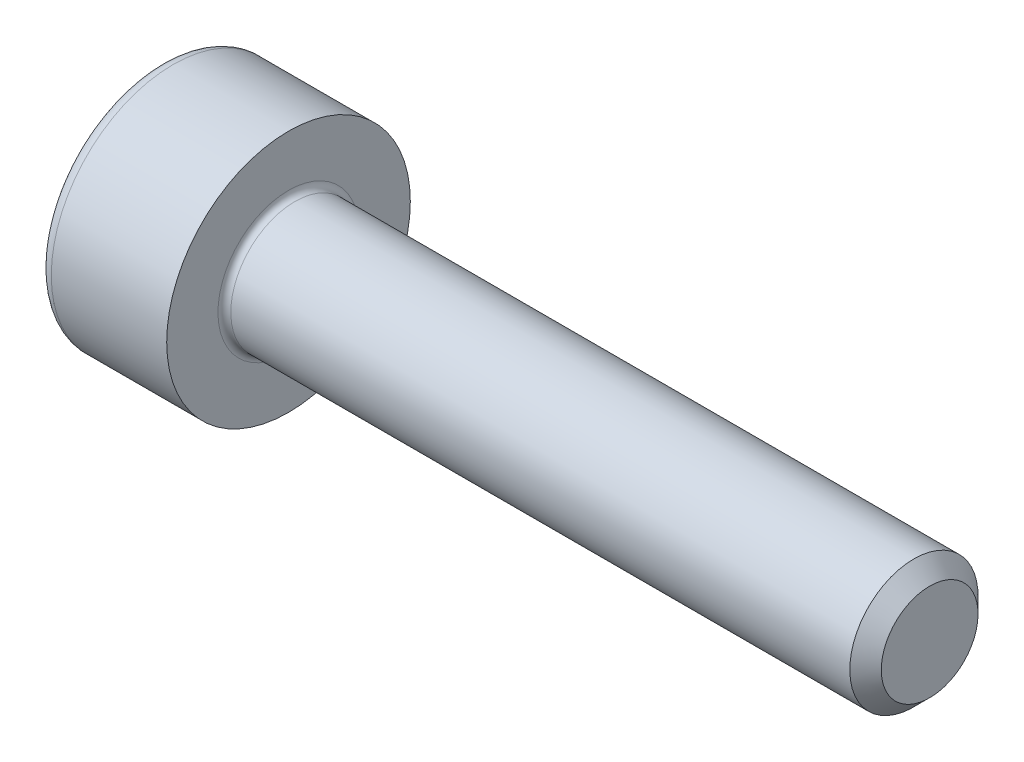
ISO-10303-21;
HEADER;
FILE_DESCRIPTION(('STEP AP214'),'2;1');
FILE_NAME('part.step','',(''),(''),'','','');
FILE_SCHEMA(('AUTOMOTIVE_DESIGN { 1 0 10303 214 1 1 1 1 }'));
ENDSEC;
DATA;
#1=APPLICATION_CONTEXT('core data for automotive mechanical design processes');
#2=APPLICATION_PROTOCOL_DEFINITION('international standard','automotive_design',2000,#1);
#3=PRODUCT_CONTEXT('',#1,'mechanical');
#4=PRODUCT('Part','Part','',(#3));
#5=PRODUCT_RELATED_PRODUCT_CATEGORY('part','',(#4));
#6=PRODUCT_DEFINITION_FORMATION('','',#4);
#7=PRODUCT_DEFINITION_CONTEXT('part definition',#1,'design');
#8=PRODUCT_DEFINITION('design','',#6,#7);
#9=PRODUCT_DEFINITION_SHAPE('','',#8);
#10=(LENGTH_UNIT() NAMED_UNIT(*) SI_UNIT(.MILLI.,.METRE.));
#11=(NAMED_UNIT(*) PLANE_ANGLE_UNIT() SI_UNIT($,.RADIAN.));
#12=(NAMED_UNIT(*) SI_UNIT($,.STERADIAN.) SOLID_ANGLE_UNIT());
#13=UNCERTAINTY_MEASURE_WITH_UNIT(LENGTH_MEASURE(1.E-05),#10,'distance_accuracy_value','');
#14=(GEOMETRIC_REPRESENTATION_CONTEXT(3) GLOBAL_UNCERTAINTY_ASSIGNED_CONTEXT((#13)) GLOBAL_UNIT_ASSIGNED_CONTEXT((#10,
#11,#12)) REPRESENTATION_CONTEXT('',''));
#15=CARTESIAN_POINT('',(0.,0.,0.));
#16=DIRECTION('',(0.,0.,1.));
#17=DIRECTION('',(1.,0.,0.));
#18=AXIS2_PLACEMENT_3D('',#15,#16,#17);
#19=CARTESIAN_POINT('',(0.100000000000002,0.,0.));
#20=DIRECTION('',(1.,0.,0.));
#21=DIRECTION('',(0.,1.,0.));
#22=AXIS2_PLACEMENT_3D('',#19,#20,#21);
#23=TOROIDAL_SURFACE('',#22,1.1,0.1);
#24=CARTESIAN_POINT('',(0.,0.,0.));
#25=DIRECTION('',(1.,0.,0.));
#26=DIRECTION('',(0.,1.,0.));
#27=AXIS2_PLACEMENT_3D('',#24,#25,#26);
#28=CIRCLE('',#27,1.1);
#29=CARTESIAN_POINT('',(0.,1.1,0.));
#30=VERTEX_POINT('',#29);
#31=EDGE_CURVE('E11',#30,#30,#28,.T.);
#32=ORIENTED_EDGE('',*,*,#31,.T.);
#33=EDGE_LOOP('',(#32));
#34=FACE_BOUND('',#33,.T.);
#35=CARTESIAN_POINT('',(0.100000000000002,0.,0.));
#36=DIRECTION('',(-1.,0.,0.));
#37=DIRECTION('',(0.,1.,0.));
#38=AXIS2_PLACEMENT_3D('',#35,#36,#37);
#39=CIRCLE('',#38,0.999999999999998);
#40=CARTESIAN_POINT('',(0.100000000000002,0.999999999999997,0.));
#41=VERTEX_POINT('',#40);
#42=EDGE_CURVE('E27',#41,#41,#39,.T.);
#43=ORIENTED_EDGE('',*,*,#42,.T.);
#44=EDGE_LOOP('',(#43));
#45=FACE_BOUND('',#44,.T.);
#46=ADVANCED_FACE('F16',(#34,#45),#23,.F.);
#47=CARTESIAN_POINT('',(5.52269,0.,0.));
#48=DIRECTION('',(1.,0.,0.));
#49=DIRECTION('',(0.,1.,0.));
#50=AXIS2_PLACEMENT_3D('',#47,#48,#49);
#51=CYLINDRICAL_SURFACE('',#50,0.999999999999998);
#52=CARTESIAN_POINT('',(9.75462,0.,0.));
#53=DIRECTION('',(1.,0.,0.));
#54=DIRECTION('',(0.,1.,0.));
#55=AXIS2_PLACEMENT_3D('',#52,#53,#54);
#56=CIRCLE('',#55,0.999999999999998);
#57=CARTESIAN_POINT('',(9.75462,0.999999999999998,0.));
#58=VERTEX_POINT('',#57);
#59=EDGE_CURVE('E161',#58,#58,#56,.T.);
#60=ORIENTED_EDGE('',*,*,#59,.F.);
#61=EDGE_LOOP('',(#60));
#62=FACE_BOUND('',#61,.T.);
#63=ORIENTED_EDGE('',*,*,#42,.F.);
#64=EDGE_LOOP('',(#63));
#65=FACE_BOUND('',#64,.T.);
#66=ADVANCED_FACE('F171',(#62,#65),#51,.T.);
#67=CARTESIAN_POINT('',(0.,1.45,0.));
#68=DIRECTION('',(1.,0.,0.));
#69=DIRECTION('',(0.,1.,0.));
#70=AXIS2_PLACEMENT_3D('',#67,#68,#69);
#71=PLANE('',#70);
#72=CARTESIAN_POINT('',(0.,0.,0.));
#73=DIRECTION('',(1.,0.,0.));
#74=DIRECTION('',(0.,1.,0.));
#75=AXIS2_PLACEMENT_3D('',#72,#73,#74);
#76=CIRCLE('',#75,1.9);
#77=CARTESIAN_POINT('',(0.,1.9,0.));
#78=VERTEX_POINT('',#77);
#79=EDGE_CURVE('E162',#78,#78,#76,.T.);
#80=ORIENTED_EDGE('',*,*,#79,.T.);
#81=EDGE_LOOP('',(#80));
#82=FACE_BOUND('',#81,.T.);
#83=ORIENTED_EDGE('',*,*,#31,.F.);
#84=EDGE_LOOP('',(#83));
#85=FACE_BOUND('',#84,.T.);
#86=ADVANCED_FACE('F173',(#82,#85),#71,.T.);
#87=CARTESIAN_POINT('',(9.87731,0.,0.));
#88=DIRECTION('',(-1.,0.,0.));
#89=DIRECTION('',(0.,1.,0.));
#90=AXIS2_PLACEMENT_3D('',#87,#88,#89);
#91=CONICAL_SURFACE('',#90,0.877309999999998,0.785398163397445);
#92=ORIENTED_EDGE('',*,*,#59,.T.);
#93=EDGE_LOOP('',(#92));
#94=FACE_BOUND('',#93,.T.);
#95=CARTESIAN_POINT('',(10.,0.,0.));
#96=DIRECTION('',(-1.,0.,0.));
#97=DIRECTION('',(0.,1.,0.));
#98=AXIS2_PLACEMENT_3D('',#95,#96,#97);
#99=CIRCLE('',#98,0.754619999999999);
#100=CARTESIAN_POINT('',(10.,0.754619999999999,0.));
#101=VERTEX_POINT('',#100);
#102=EDGE_CURVE('E158',#101,#101,#99,.T.);
#103=ORIENTED_EDGE('',*,*,#102,.T.);
#104=EDGE_LOOP('',(#103));
#105=FACE_BOUND('',#104,.T.);
#106=ADVANCED_FACE('F181',(#94,#105),#91,.T.);
#107=CARTESIAN_POINT('',(10.,0.499999999999999,0.));
#108=DIRECTION('',(1.,0.,0.));
#109=DIRECTION('',(0.,1.,0.));
#110=AXIS2_PLACEMENT_3D('',#107,#108,#109);
#111=PLANE('',#110);
#112=ORIENTED_EDGE('',*,*,#102,.F.);
#113=EDGE_LOOP('',(#112));
#114=FACE_BOUND('',#113,.T.);
#115=ADVANCED_FACE('F191',(#114),#111,.T.);
#116=CARTESIAN_POINT('',(-1.8,0.,0.));
#117=DIRECTION('',(1.,0.,0.));
#118=DIRECTION('',(0.,1.,0.));
#119=AXIS2_PLACEMENT_3D('',#116,#117,#118);
#120=TOROIDAL_SURFACE('',#119,1.7,0.2);
#121=CARTESIAN_POINT('',(-2.,0.,0.));
#122=DIRECTION('',(1.,0.,0.));
#123=DIRECTION('',(0.,1.,0.));
#124=AXIS2_PLACEMENT_3D('',#121,#122,#123);
#125=CIRCLE('',#124,1.7);
#126=CARTESIAN_POINT('',(-2.,1.7,0.));
#127=VERTEX_POINT('',#126);
#128=EDGE_CURVE('E155',#127,#127,#125,.T.);
#129=ORIENTED_EDGE('',*,*,#128,.T.);
#130=EDGE_LOOP('',(#129));
#131=FACE_BOUND('',#130,.T.);
#132=CARTESIAN_POINT('',(-1.8,0.,0.));
#133=DIRECTION('',(-1.,0.,0.));
#134=DIRECTION('',(0.,1.,0.));
#135=AXIS2_PLACEMENT_3D('',#132,#133,#134);
#136=CIRCLE('',#135,1.9);
#137=CARTESIAN_POINT('',(-1.8,1.9,0.));
#138=VERTEX_POINT('',#137);
#139=EDGE_CURVE('E152',#138,#138,#136,.T.);
#140=ORIENTED_EDGE('',*,*,#139,.T.);
#141=EDGE_LOOP('',(#140));
#142=FACE_BOUND('',#141,.T.);
#143=ADVANCED_FACE('F205',(#131,#142),#120,.T.);
#144=CARTESIAN_POINT('',(-2.,1.38301270189222,0.));
#145=DIRECTION('',(-1.,0.,0.));
#146=DIRECTION('',(0.,-1.,0.));
#147=AXIS2_PLACEMENT_3D('',#144,#145,#146);
#148=PLANE('',#147);
#149=DIRECTION('',(0.,0.,1.));
#150=VECTOR('',#149,1.);
#151=CARTESIAN_POINT('',(-2.,0.75,0.216506350946109));
#152=LINE('',#151,#150);
#153=CARTESIAN_POINT('',(-2.,0.749999999999999,-0.43301270189222));
#154=VERTEX_POINT('',#153);
#155=CARTESIAN_POINT('',(-2.,0.750000000000001,0.433012701892219));
#156=VERTEX_POINT('',#155);
#157=EDGE_CURVE('E150',#154,#156,#152,.T.);
#158=ORIENTED_EDGE('',*,*,#157,.T.);
#159=DIRECTION('',(0.,-0.866025403784438,0.500000000000001));
#160=VECTOR('',#159,1.);
#161=CARTESIAN_POINT('',(-2.,0.1875,0.757772228311384));
#162=LINE('',#161,#160);
#163=CARTESIAN_POINT('',(-2.,0.,0.866025403784439));
#164=VERTEX_POINT('',#163);
#165=EDGE_CURVE('E39',#156,#164,#162,.T.);
#166=ORIENTED_EDGE('',*,*,#165,.T.);
#167=DIRECTION('',(0.,-0.866025403784439,-0.5));
#168=VECTOR('',#167,1.);
#169=CARTESIAN_POINT('',(-2.,-0.5625,0.541265877365275));
#170=LINE('',#169,#168);
#171=CARTESIAN_POINT('',(-2.,-0.75,0.43301270189222));
#172=VERTEX_POINT('',#171);
#173=EDGE_CURVE('E95',#164,#172,#170,.T.);
#174=ORIENTED_EDGE('',*,*,#173,.T.);
#175=DIRECTION('',(0.,0.,-1.));
#176=VECTOR('',#175,1.);
#177=CARTESIAN_POINT('',(-2.,-0.75,-0.21650635094611));
#178=LINE('',#177,#176);
#179=CARTESIAN_POINT('',(-2.,-0.75,-0.433012701892219));
#180=VERTEX_POINT('',#179);
#181=EDGE_CURVE('E88',#172,#180,#178,.T.);
#182=ORIENTED_EDGE('',*,*,#181,.T.);
#183=DIRECTION('',(0.,0.866025403784438,-0.5));
#184=VECTOR('',#183,1.);
#185=CARTESIAN_POINT('',(-2.,-0.1875,-0.757772228311384));
#186=LINE('',#185,#184);
#187=CARTESIAN_POINT('',(-2.,0.,-0.866025403784439));
#188=VERTEX_POINT('',#187);
#189=EDGE_CURVE('E144',#180,#188,#186,.T.);
#190=ORIENTED_EDGE('',*,*,#189,.T.);
#191=DIRECTION('',(0.,0.866025403784439,0.5));
#192=VECTOR('',#191,1.);
#193=CARTESIAN_POINT('',(-2.,0.5625,-0.541265877365275));
#194=LINE('',#193,#192);
#195=EDGE_CURVE('E135',#188,#154,#194,.T.);
#196=ORIENTED_EDGE('',*,*,#195,.T.);
#197=EDGE_LOOP('',(#158,#166,#174,#182,#190,#196));
#198=FACE_BOUND('',#197,.T.);
#199=ORIENTED_EDGE('',*,*,#128,.F.);
#200=EDGE_LOOP('',(#199));
#201=FACE_BOUND('',#200,.T.);
#202=ADVANCED_FACE('F196',(#198,#201),#148,.T.);
#203=CARTESIAN_POINT('',(-0.999999999999997,0.,0.));
#204=DIRECTION('',(1.,0.,0.));
#205=DIRECTION('',(0.,1.,0.));
#206=AXIS2_PLACEMENT_3D('',#203,#204,#205);
#207=CYLINDRICAL_SURFACE('',#206,1.9);
#208=ORIENTED_EDGE('',*,*,#79,.F.);
#209=EDGE_LOOP('',(#208));
#210=FACE_BOUND('',#209,.T.);
#211=ORIENTED_EDGE('',*,*,#139,.F.);
#212=EDGE_LOOP('',(#211));
#213=FACE_BOUND('',#212,.T.);
#214=ADVANCED_FACE('F193',(#210,#213),#207,.T.);
#215=CARTESIAN_POINT('',(-2.,0.,-0.866025403784439));
#216=DIRECTION('',(0.,-0.5,-0.866025403784438));
#217=DIRECTION('',(0.,0.866025403784438,-0.5));
#218=AXIS2_PLACEMENT_3D('',#215,#216,#217);
#219=PLANE('',#218);
#220=CARTESIAN_POINT('',(-0.999999999999998,0.,-0.86602540378444));
#221=CARTESIAN_POINT('',(-0.874999999999996,-0.375,-0.649519052838329));
#222=CARTESIAN_POINT('',(-0.999999999999998,-0.750000000000003,-0.433012701892218));
#223=(BOUNDED_CURVE() B_SPLINE_CURVE(2,(#220,#221,#222),.UNSPECIFIED.,.F.,
.F.) B_SPLINE_CURVE_WITH_KNOTS((3,3),(0.,0.0876327103558444),
.UNSPECIFIED.) CURVE() GEOMETRIC_REPRESENTATION_ITEM() RATIONAL_B_SPLINE_CURVE((1.,
1.15470053837925,1.)) REPRESENTATION_ITEM(''));
#224=CARTESIAN_POINT('',(-0.999999999999997,0.,-0.866025403784439));
#225=VERTEX_POINT('',#224);
#226=CARTESIAN_POINT('',(-0.999999999999997,-0.750000000000001,-0.433012701892219));
#227=VERTEX_POINT('',#226);
#228=EDGE_CURVE('E79',#225,#227,#223,.T.);
#229=ORIENTED_EDGE('',*,*,#228,.F.);
#230=DIRECTION('',(-1.,0.,0.));
#231=VECTOR('',#230,1.);
#232=CARTESIAN_POINT('',(-1.5,0.,-0.866025403784439));
#233=LINE('',#232,#231);
#234=EDGE_CURVE('E125',#225,#188,#233,.T.);
#235=ORIENTED_EDGE('',*,*,#234,.T.);
#236=ORIENTED_EDGE('',*,*,#189,.F.);
#237=DIRECTION('',(-1.,0.,0.));
#238=VECTOR('',#237,1.);
#239=CARTESIAN_POINT('',(-1.5,-0.750000000000001,-0.433012701892219));
#240=LINE('',#239,#238);
#241=EDGE_CURVE('E91',#227,#180,#240,.T.);
#242=ORIENTED_EDGE('',*,*,#241,.F.);
#243=EDGE_LOOP('',(#229,#235,#236,#242));
#244=FACE_BOUND('',#243,.T.);
#245=ADVANCED_FACE('F195',(#244),#219,.F.);
#246=CARTESIAN_POINT('',(-2.,0.749999999999999,-0.43301270189222));
#247=DIRECTION('',(0.,0.5,-0.866025403784439));
#248=DIRECTION('',(0.,0.866025403784439,0.5));
#249=AXIS2_PLACEMENT_3D('',#246,#247,#248);
#250=PLANE('',#249);
#251=CARTESIAN_POINT('',(-0.999999999999998,0.750000000000002,-0.433012701892219));
#252=CARTESIAN_POINT('',(-0.874999999999997,0.375,-0.64951905283833));
#253=CARTESIAN_POINT('',(-0.999999999999998,0.,-0.86602540378444));
#254=(BOUNDED_CURVE() B_SPLINE_CURVE(2,(#251,#252,#253),.UNSPECIFIED.,.F.,
.F.) B_SPLINE_CURVE_WITH_KNOTS((3,3),(0.,0.0876327103558443),
.UNSPECIFIED.) CURVE() GEOMETRIC_REPRESENTATION_ITEM() RATIONAL_B_SPLINE_CURVE((1.,
1.15470053837925,1.)) REPRESENTATION_ITEM(''));
#255=CARTESIAN_POINT('',(-0.999999999999997,0.749999999999999,-0.433012701892221));
#256=VERTEX_POINT('',#255);
#257=EDGE_CURVE('E119',#256,#225,#254,.T.);
#258=ORIENTED_EDGE('',*,*,#257,.F.);
#259=DIRECTION('',(-1.,0.,0.));
#260=VECTOR('',#259,1.);
#261=CARTESIAN_POINT('',(-1.5,0.749999999999999,-0.433012701892221));
#262=LINE('',#261,#260);
#263=EDGE_CURVE('E114',#256,#154,#262,.T.);
#264=ORIENTED_EDGE('',*,*,#263,.T.);
#265=ORIENTED_EDGE('',*,*,#195,.F.);
#266=ORIENTED_EDGE('',*,*,#234,.F.);
#267=EDGE_LOOP('',(#258,#264,#265,#266));
#268=FACE_BOUND('',#267,.T.);
#269=ADVANCED_FACE('F202',(#268),#250,.F.);
#270=CARTESIAN_POINT('',(-2.,0.750000000000001,0.433012701892219));
#271=DIRECTION('',(0.,1.,0.));
#272=DIRECTION('',(0.,0.,1.));
#273=AXIS2_PLACEMENT_3D('',#270,#271,#272);
#274=PLANE('',#273);
#275=CARTESIAN_POINT('',(-0.999999999999998,0.750000000000001,0.433012701892221));
#276=CARTESIAN_POINT('',(-0.874999999999997,0.75,0.));
#277=CARTESIAN_POINT('',(-0.999999999999998,0.749999999999999,-0.433012701892223));
#278=(BOUNDED_CURVE() B_SPLINE_CURVE(2,(#275,#276,#277),.UNSPECIFIED.,.F.,
.F.) B_SPLINE_CURVE_WITH_KNOTS((3,3),(0.,0.0876327103558444),
.UNSPECIFIED.) CURVE() GEOMETRIC_REPRESENTATION_ITEM() RATIONAL_B_SPLINE_CURVE((1.,
1.15470053837925,1.)) REPRESENTATION_ITEM(''));
#279=CARTESIAN_POINT('',(-0.999999999999997,0.750000000000001,0.433012701892218));
#280=VERTEX_POINT('',#279);
#281=EDGE_CURVE('E98',#280,#256,#278,.T.);
#282=ORIENTED_EDGE('',*,*,#281,.F.);
#283=DIRECTION('',(-1.,0.,0.));
#284=VECTOR('',#283,1.);
#285=CARTESIAN_POINT('',(-1.5,0.750000000000001,0.433012701892218));
#286=LINE('',#285,#284);
#287=EDGE_CURVE('E108',#280,#156,#286,.T.);
#288=ORIENTED_EDGE('',*,*,#287,.T.);
#289=ORIENTED_EDGE('',*,*,#157,.F.);
#290=ORIENTED_EDGE('',*,*,#263,.F.);
#291=EDGE_LOOP('',(#282,#288,#289,#290));
#292=FACE_BOUND('',#291,.T.);
#293=ADVANCED_FACE('F223',(#292),#274,.F.);
#294=CARTESIAN_POINT('',(-2.,0.,0.866025403784439));
#295=DIRECTION('',(0.,0.500000000000001,0.866025403784438));
#296=DIRECTION('',(0.,-0.866025403784438,0.500000000000001));
#297=AXIS2_PLACEMENT_3D('',#294,#295,#296);
#298=PLANE('',#297);
#299=CARTESIAN_POINT('',(-0.999999999999998,0.,0.86602540378444));
#300=CARTESIAN_POINT('',(-0.874999999999996,0.375,0.649519052838329));
#301=CARTESIAN_POINT('',(-0.999999999999998,0.750000000000003,0.433012701892218));
#302=(BOUNDED_CURVE() B_SPLINE_CURVE(2,(#299,#300,#301),.UNSPECIFIED.,.F.,
.F.) B_SPLINE_CURVE_WITH_KNOTS((3,3),(0.,0.0876327103558444),
.UNSPECIFIED.) CURVE() GEOMETRIC_REPRESENTATION_ITEM() RATIONAL_B_SPLINE_CURVE((1.,
1.15470053837925,1.)) REPRESENTATION_ITEM(''));
#303=CARTESIAN_POINT('',(-0.999999999999997,0.,0.866025403784439));
#304=VERTEX_POINT('',#303);
#305=EDGE_CURVE('E96',#304,#280,#302,.T.);
#306=ORIENTED_EDGE('',*,*,#305,.F.);
#307=DIRECTION('',(1.,0.,0.));
#308=VECTOR('',#307,1.);
#309=CARTESIAN_POINT('',(-1.5,0.,0.866025403784439));
#310=LINE('',#309,#308);
#311=EDGE_CURVE('E92',#164,#304,#310,.T.);
#312=ORIENTED_EDGE('',*,*,#311,.F.);
#313=ORIENTED_EDGE('',*,*,#165,.F.);
#314=ORIENTED_EDGE('',*,*,#287,.F.);
#315=EDGE_LOOP('',(#306,#312,#313,#314));
#316=FACE_BOUND('',#315,.T.);
#317=ADVANCED_FACE('F227',(#316),#298,.F.);
#318=CARTESIAN_POINT('',(-2.,-0.75,-0.433012701892219));
#319=DIRECTION('',(0.,-1.,0.));
#320=DIRECTION('',(1.,0.,0.));
#321=AXIS2_PLACEMENT_3D('',#318,#319,#320);
#322=PLANE('',#321);
#323=CARTESIAN_POINT('',(-0.999999999999998,-0.75,-0.433012701892222));
#324=CARTESIAN_POINT('',(-0.874999999999997,-0.75,0.));
#325=CARTESIAN_POINT('',(-0.999999999999998,-0.75,0.433012701892222));
#326=(BOUNDED_CURVE() B_SPLINE_CURVE(2,(#323,#324,#325),.UNSPECIFIED.,.F.,
.F.) B_SPLINE_CURVE_WITH_KNOTS((3,3),(0.,0.0876327103558444),
.UNSPECIFIED.) CURVE() GEOMETRIC_REPRESENTATION_ITEM() RATIONAL_B_SPLINE_CURVE((1.,
1.15470053837925,1.)) REPRESENTATION_ITEM(''));
#327=CARTESIAN_POINT('',(-0.999999999999997,-0.75,0.43301270189222));
#328=VERTEX_POINT('',#327);
#329=EDGE_CURVE('E74',#227,#328,#326,.T.);
#330=ORIENTED_EDGE('',*,*,#329,.F.);
#331=ORIENTED_EDGE('',*,*,#241,.T.);
#332=ORIENTED_EDGE('',*,*,#181,.F.);
#333=DIRECTION('',(-1.,0.,0.));
#334=VECTOR('',#333,1.);
#335=CARTESIAN_POINT('',(-1.5,-0.75,0.43301270189222));
#336=LINE('',#335,#334);
#337=EDGE_CURVE('E85',#328,#172,#336,.T.);
#338=ORIENTED_EDGE('',*,*,#337,.F.);
#339=EDGE_LOOP('',(#330,#331,#332,#338));
#340=FACE_BOUND('',#339,.T.);
#341=ADVANCED_FACE('F86',(#340),#322,.F.);
#342=CARTESIAN_POINT('',(-2.,-0.75,0.43301270189222));
#343=DIRECTION('',(0.,-0.5,0.866025403784439));
#344=DIRECTION('',(0.,-0.866025403784439,-0.5));
#345=AXIS2_PLACEMENT_3D('',#342,#343,#344);
#346=PLANE('',#345);
#347=CARTESIAN_POINT('',(-0.999999999999998,-0.750000000000002,0.433012701892219));
#348=CARTESIAN_POINT('',(-0.874999999999997,-0.375,0.64951905283833));
#349=CARTESIAN_POINT('',(-0.999999999999998,0.,0.86602540378444));
#350=(BOUNDED_CURVE() B_SPLINE_CURVE(2,(#347,#348,#349),.UNSPECIFIED.,.F.,
.F.) B_SPLINE_CURVE_WITH_KNOTS((3,3),(0.,0.0876327103558443),
.UNSPECIFIED.) CURVE() GEOMETRIC_REPRESENTATION_ITEM() RATIONAL_B_SPLINE_CURVE((1.,
1.15470053837925,1.)) REPRESENTATION_ITEM(''));
#351=EDGE_CURVE('E20',#328,#304,#350,.T.);
#352=ORIENTED_EDGE('',*,*,#351,.F.);
#353=ORIENTED_EDGE('',*,*,#337,.T.);
#354=ORIENTED_EDGE('',*,*,#173,.F.);
#355=ORIENTED_EDGE('',*,*,#311,.T.);
#356=EDGE_LOOP('',(#352,#353,#354,#355));
#357=FACE_BOUND('',#356,.T.);
#358=ADVANCED_FACE('F94',(#357),#346,.F.);
#359=CARTESIAN_POINT('',(-0.749999999999997,0.,0.));
#360=DIRECTION('',(-1.,0.,0.));
#361=DIRECTION('',(0.,1.,0.));
#362=AXIS2_PLACEMENT_3D('',#359,#360,#361);
#363=CONICAL_SURFACE('',#362,0.43301270189222,1.0471975511966);
#364=CARTESIAN_POINT('',(-0.499999999999998,0.,0.));
#365=VERTEX_POINT('',#364);
#366=VERTEX_LOOP('',#365);
#367=FACE_BOUND('',#366,.T.);
#368=ORIENTED_EDGE('',*,*,#305,.T.);
#369=ORIENTED_EDGE('',*,*,#281,.T.);
#370=ORIENTED_EDGE('',*,*,#257,.T.);
#371=ORIENTED_EDGE('',*,*,#228,.T.);
#372=ORIENTED_EDGE('',*,*,#329,.T.);
#373=ORIENTED_EDGE('',*,*,#351,.T.);
#374=EDGE_LOOP('',(#368,#369,#370,#371,#372,#373));
#375=FACE_BOUND('',#374,.T.);
#376=ADVANCED_FACE('F18',(#367,#375),#363,.F.);
#377=CLOSED_SHELL('',(#46,#66,#86,#106,#115,#143,#202,#214,#245,#269,#293,#317,#341,#358,#376));
#378=MANIFOLD_SOLID_BREP('B1',#377);
#379=ADVANCED_BREP_SHAPE_REPRESENTATION('',(#18,#378),#14);
#380=SHAPE_DEFINITION_REPRESENTATION(#9,#379);
ENDSEC;
END-ISO-10303-21;
